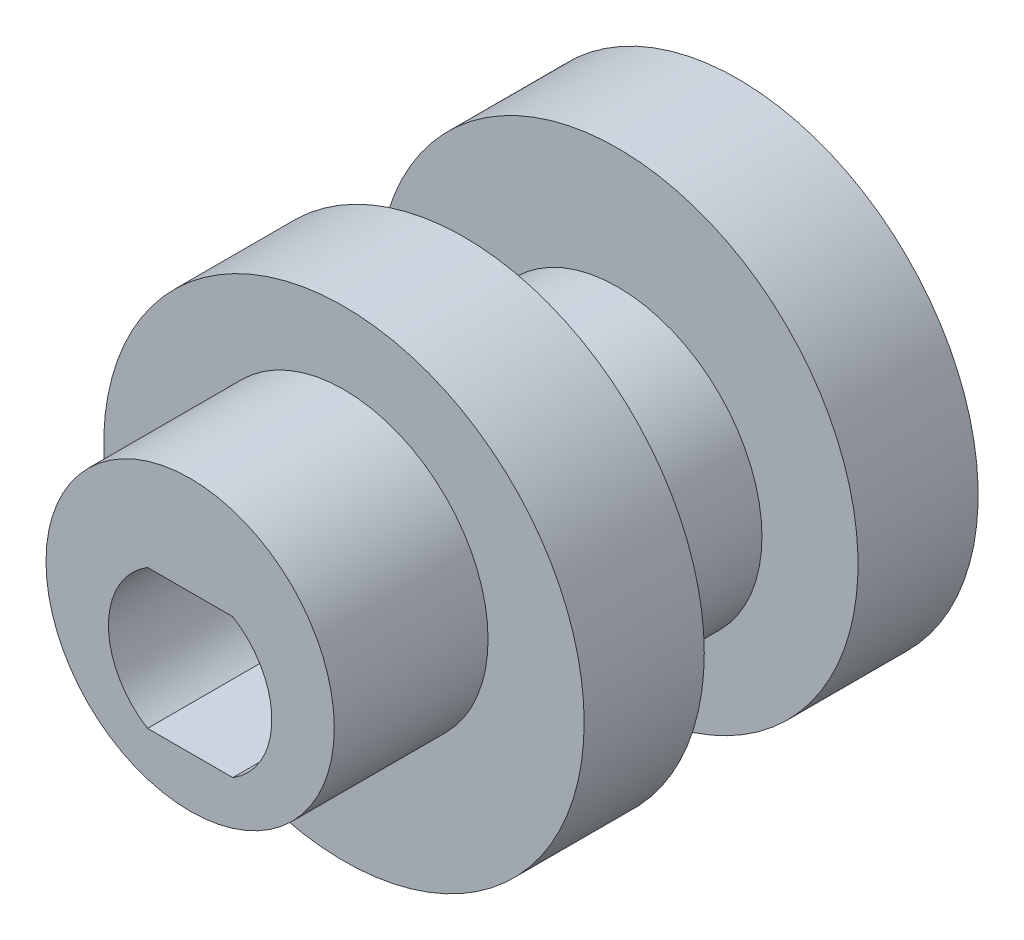
ISO-10303-21;
HEADER;
FILE_DESCRIPTION(('STEP AP214'),'2;1');
FILE_NAME('part.step','',(''),(''),'','','');
FILE_SCHEMA(('AUTOMOTIVE_DESIGN { 1 0 10303 214 1 1 1 1 }'));
ENDSEC;
DATA;
#1=APPLICATION_CONTEXT('core data for automotive mechanical design processes');
#2=APPLICATION_PROTOCOL_DEFINITION('international standard','automotive_design',2000,#1);
#3=PRODUCT_CONTEXT('',#1,'mechanical');
#4=PRODUCT('Part','Part','',(#3));
#5=PRODUCT_RELATED_PRODUCT_CATEGORY('part','',(#4));
#6=PRODUCT_DEFINITION_FORMATION('','',#4);
#7=PRODUCT_DEFINITION_CONTEXT('part definition',#1,'design');
#8=PRODUCT_DEFINITION('design','',#6,#7);
#9=PRODUCT_DEFINITION_SHAPE('','',#8);
#10=(LENGTH_UNIT() NAMED_UNIT(*) SI_UNIT(.MILLI.,.METRE.));
#11=(NAMED_UNIT(*) PLANE_ANGLE_UNIT() SI_UNIT($,.RADIAN.));
#12=(NAMED_UNIT(*) SI_UNIT($,.STERADIAN.) SOLID_ANGLE_UNIT());
#13=UNCERTAINTY_MEASURE_WITH_UNIT(LENGTH_MEASURE(1.E-05),#10,'distance_accuracy_value','');
#14=(GEOMETRIC_REPRESENTATION_CONTEXT(3) GLOBAL_UNCERTAINTY_ASSIGNED_CONTEXT((#13)) GLOBAL_UNIT_ASSIGNED_CONTEXT((#10,
#11,#12)) REPRESENTATION_CONTEXT('',''));
#15=CARTESIAN_POINT('',(0.,0.,0.));
#16=DIRECTION('',(0.,0.,1.));
#17=DIRECTION('',(1.,0.,0.));
#18=AXIS2_PLACEMENT_3D('',#15,#16,#17);
#19=CARTESIAN_POINT('',(0.,0.,2.5));
#20=DIRECTION('',(0.,0.,-1.));
#21=DIRECTION('',(-1.,0.,0.));
#22=AXIS2_PLACEMENT_3D('',#19,#20,#21);
#23=CYLINDRICAL_SURFACE('',#22,10.);
#24=CARTESIAN_POINT('',(0.,0.,2.5));
#25=DIRECTION('',(0.,0.,1.));
#26=DIRECTION('',(1.,0.,0.));
#27=AXIS2_PLACEMENT_3D('',#24,#25,#26);
#28=CIRCLE('',#27,10.);
#29=CARTESIAN_POINT('',(10.,0.,2.5));
#30=VERTEX_POINT('',#29);
#31=EDGE_CURVE('E153',#30,#30,#28,.T.);
#32=ORIENTED_EDGE('',*,*,#31,.F.);
#33=EDGE_LOOP('',(#32));
#34=FACE_BOUND('',#33,.T.);
#35=CARTESIAN_POINT('',(0.,0.,-2.5));
#36=DIRECTION('',(0.,0.,1.));
#37=DIRECTION('',(1.,0.,0.));
#38=AXIS2_PLACEMENT_3D('',#35,#36,#37);
#39=CIRCLE('',#38,10.);
#40=CARTESIAN_POINT('',(10.,0.,-2.5));
#41=VERTEX_POINT('',#40);
#42=EDGE_CURVE('E48',#41,#41,#39,.T.);
#43=ORIENTED_EDGE('',*,*,#42,.T.);
#44=EDGE_LOOP('',(#43));
#45=FACE_BOUND('',#44,.T.);
#46=ADVANCED_FACE('F45',(#34,#45),#23,.T.);
#47=CARTESIAN_POINT('',(0.,0.,2.5));
#48=DIRECTION('',(0.,0.,1.));
#49=DIRECTION('',(1.,0.,0.));
#50=AXIS2_PLACEMENT_3D('',#47,#48,#49);
#51=PLANE('',#50);
#52=CARTESIAN_POINT('',(0.,1.,2.5));
#53=DIRECTION('',(0.,0.,1.));
#54=DIRECTION('',(1.,0.,0.));
#55=AXIS2_PLACEMENT_3D('',#52,#53,#54);
#56=CIRCLE('',#55,6.);
#57=CARTESIAN_POINT('',(6.,1.,2.5));
#58=VERTEX_POINT('',#57);
#59=EDGE_CURVE('E54',#58,#58,#56,.T.);
#60=ORIENTED_EDGE('',*,*,#59,.F.);
#61=EDGE_LOOP('',(#60));
#62=FACE_BOUND('',#61,.T.);
#63=ORIENTED_EDGE('',*,*,#31,.T.);
#64=EDGE_LOOP('',(#63));
#65=FACE_BOUND('',#64,.T.);
#66=ADVANCED_FACE('F166',(#62,#65),#51,.T.);
#67=CARTESIAN_POINT('',(0.,0.,-2.5));
#68=DIRECTION('',(0.,0.,1.));
#69=DIRECTION('',(1.,0.,0.));
#70=AXIS2_PLACEMENT_3D('',#67,#68,#69);
#71=PLANE('',#70);
#72=CARTESIAN_POINT('',(0.,-1.,-2.5));
#73=DIRECTION('',(0.,0.,-1.));
#74=DIRECTION('',(-1.,0.,0.));
#75=AXIS2_PLACEMENT_3D('',#72,#73,#74);
#76=CIRCLE('',#75,6.);
#77=CARTESIAN_POINT('',(-6.,-1.,-2.5));
#78=VERTEX_POINT('',#77);
#79=EDGE_CURVE('E11',#78,#78,#76,.T.);
#80=ORIENTED_EDGE('',*,*,#79,.F.);
#81=EDGE_LOOP('',(#80));
#82=FACE_BOUND('',#81,.T.);
#83=ORIENTED_EDGE('',*,*,#42,.F.);
#84=EDGE_LOOP('',(#83));
#85=FACE_BOUND('',#84,.T.);
#86=ADVANCED_FACE('F163',(#82,#85),#71,.F.);
#87=CARTESIAN_POINT('',(0.,1.,8.9));
#88=DIRECTION('',(0.,0.,-1.));
#89=DIRECTION('',(-1.,0.,0.));
#90=AXIS2_PLACEMENT_3D('',#87,#88,#89);
#91=CYLINDRICAL_SURFACE('',#90,6.);
#92=CARTESIAN_POINT('',(0.,1.,8.9));
#93=DIRECTION('',(0.,0.,1.));
#94=DIRECTION('',(1.,0.,0.));
#95=AXIS2_PLACEMENT_3D('',#92,#93,#94);
#96=CIRCLE('',#95,6.);
#97=CARTESIAN_POINT('',(6.,1.,8.9));
#98=VERTEX_POINT('',#97);
#99=EDGE_CURVE('E146',#98,#98,#96,.T.);
#100=ORIENTED_EDGE('',*,*,#99,.F.);
#101=EDGE_LOOP('',(#100));
#102=FACE_BOUND('',#101,.T.);
#103=ORIENTED_EDGE('',*,*,#59,.T.);
#104=EDGE_LOOP('',(#103));
#105=FACE_BOUND('',#104,.T.);
#106=ADVANCED_FACE('F165',(#102,#105),#91,.T.);
#107=CARTESIAN_POINT('',(0.,1.,8.9));
#108=DIRECTION('',(0.,0.,1.));
#109=DIRECTION('',(1.,0.,0.));
#110=AXIS2_PLACEMENT_3D('',#107,#108,#109);
#111=PLANE('',#110);
#112=CARTESIAN_POINT('',(0.,0.,8.9));
#113=DIRECTION('',(0.,0.,1.));
#114=DIRECTION('',(1.,0.,0.));
#115=AXIS2_PLACEMENT_3D('',#112,#113,#114);
#116=CIRCLE('',#115,3.4);
#117=CARTESIAN_POINT('',(-1.77482393492988,2.9,8.9));
#118=VERTEX_POINT('',#117);
#119=CARTESIAN_POINT('',(-1.77482393492988,-2.9,8.9));
#120=VERTEX_POINT('',#119);
#121=EDGE_CURVE('E62',#118,#120,#116,.T.);
#122=ORIENTED_EDGE('',*,*,#121,.F.);
#123=DIRECTION('',(-1.,0.,0.));
#124=VECTOR('',#123,1.);
#125=CARTESIAN_POINT('',(-1.77482393492988,2.9,8.9));
#126=LINE('',#125,#124);
#127=CARTESIAN_POINT('',(1.77482393492989,2.9,8.9));
#128=VERTEX_POINT('',#127);
#129=EDGE_CURVE('E108',#128,#118,#126,.T.);
#130=ORIENTED_EDGE('',*,*,#129,.F.);
#131=CARTESIAN_POINT('',(0.,0.,8.9));
#132=DIRECTION('',(0.,0.,1.));
#133=DIRECTION('',(1.,0.,0.));
#134=AXIS2_PLACEMENT_3D('',#131,#132,#133);
#135=CIRCLE('',#134,3.4);
#136=CARTESIAN_POINT('',(1.77482393492988,-2.9,8.9));
#137=VERTEX_POINT('',#136);
#138=EDGE_CURVE('E90',#137,#128,#135,.T.);
#139=ORIENTED_EDGE('',*,*,#138,.F.);
#140=DIRECTION('',(1.,0.,0.));
#141=VECTOR('',#140,1.);
#142=CARTESIAN_POINT('',(-1.77482393492988,-2.9,8.9));
#143=LINE('',#142,#141);
#144=EDGE_CURVE('E100',#120,#137,#143,.T.);
#145=ORIENTED_EDGE('',*,*,#144,.F.);
#146=EDGE_LOOP('',(#122,#130,#139,#145));
#147=FACE_BOUND('',#146,.T.);
#148=ORIENTED_EDGE('',*,*,#99,.T.);
#149=EDGE_LOOP('',(#148));
#150=FACE_BOUND('',#149,.T.);
#151=ADVANCED_FACE('F105',(#147,#150),#111,.T.);
#152=CARTESIAN_POINT('',(0.,-1.,-8.9));
#153=DIRECTION('',(0.,0.,1.));
#154=DIRECTION('',(1.,0.,0.));
#155=AXIS2_PLACEMENT_3D('',#152,#153,#154);
#156=CYLINDRICAL_SURFACE('',#155,6.);
#157=CARTESIAN_POINT('',(0.,-1.,-8.9));
#158=DIRECTION('',(0.,0.,-1.));
#159=DIRECTION('',(-1.,0.,0.));
#160=AXIS2_PLACEMENT_3D('',#157,#158,#159);
#161=CIRCLE('',#160,6.);
#162=CARTESIAN_POINT('',(-6.,-1.,-8.9));
#163=VERTEX_POINT('',#162);
#164=EDGE_CURVE('E140',#163,#163,#161,.T.);
#165=ORIENTED_EDGE('',*,*,#164,.F.);
#166=EDGE_LOOP('',(#165));
#167=FACE_BOUND('',#166,.T.);
#168=ORIENTED_EDGE('',*,*,#79,.T.);
#169=EDGE_LOOP('',(#168));
#170=FACE_BOUND('',#169,.T.);
#171=ADVANCED_FACE('F205',(#167,#170),#156,.T.);
#172=CARTESIAN_POINT('',(0.,0.,-13.9));
#173=DIRECTION('',(0.,0.,1.));
#174=DIRECTION('',(1.,0.,0.));
#175=AXIS2_PLACEMENT_3D('',#172,#173,#174);
#176=CYLINDRICAL_SURFACE('',#175,10.);
#177=CARTESIAN_POINT('',(0.,0.,-13.9));
#178=DIRECTION('',(0.,0.,-1.));
#179=DIRECTION('',(-1.,0.,0.));
#180=AXIS2_PLACEMENT_3D('',#177,#178,#179);
#181=CIRCLE('',#180,10.);
#182=CARTESIAN_POINT('',(-10.,0.,-13.9));
#183=VERTEX_POINT('',#182);
#184=EDGE_CURVE('E136',#183,#183,#181,.T.);
#185=ORIENTED_EDGE('',*,*,#184,.F.);
#186=EDGE_LOOP('',(#185));
#187=FACE_BOUND('',#186,.T.);
#188=CARTESIAN_POINT('',(0.,0.,-8.9));
#189=DIRECTION('',(0.,0.,-1.));
#190=DIRECTION('',(-1.,0.,0.));
#191=AXIS2_PLACEMENT_3D('',#188,#189,#190);
#192=CIRCLE('',#191,10.);
#193=CARTESIAN_POINT('',(-10.,0.,-8.9));
#194=VERTEX_POINT('',#193);
#195=EDGE_CURVE('E131',#194,#194,#192,.T.);
#196=ORIENTED_EDGE('',*,*,#195,.T.);
#197=EDGE_LOOP('',(#196));
#198=FACE_BOUND('',#197,.T.);
#199=ADVANCED_FACE('F215',(#187,#198),#176,.T.);
#200=CARTESIAN_POINT('',(0.,0.,-13.9));
#201=DIRECTION('',(0.,0.,-1.));
#202=DIRECTION('',(-1.,0.,0.));
#203=AXIS2_PLACEMENT_3D('',#200,#201,#202);
#204=PLANE('',#203);
#205=CARTESIAN_POINT('',(0.,0.,-13.9));
#206=DIRECTION('',(0.,0.,1.));
#207=DIRECTION('',(1.,0.,0.));
#208=AXIS2_PLACEMENT_3D('',#205,#206,#207);
#209=CIRCLE('',#208,3.4);
#210=CARTESIAN_POINT('',(-1.77482393492988,2.9,-13.9));
#211=VERTEX_POINT('',#210);
#212=CARTESIAN_POINT('',(-1.77482393492988,-2.9,-13.9));
#213=VERTEX_POINT('',#212);
#214=EDGE_CURVE('E112',#211,#213,#209,.T.);
#215=ORIENTED_EDGE('',*,*,#214,.T.);
#216=DIRECTION('',(1.,0.,0.));
#217=VECTOR('',#216,1.);
#218=CARTESIAN_POINT('',(-1.77482393492988,-2.9,-13.9));
#219=LINE('',#218,#217);
#220=CARTESIAN_POINT('',(1.77482393492988,-2.9,-13.9));
#221=VERTEX_POINT('',#220);
#222=EDGE_CURVE('E119',#213,#221,#219,.T.);
#223=ORIENTED_EDGE('',*,*,#222,.T.);
#224=CARTESIAN_POINT('',(0.,0.,-13.9));
#225=DIRECTION('',(0.,0.,1.));
#226=DIRECTION('',(1.,0.,0.));
#227=AXIS2_PLACEMENT_3D('',#224,#225,#226);
#228=CIRCLE('',#227,3.4);
#229=CARTESIAN_POINT('',(1.77482393492989,2.9,-13.9));
#230=VERTEX_POINT('',#229);
#231=EDGE_CURVE('E70',#221,#230,#228,.T.);
#232=ORIENTED_EDGE('',*,*,#231,.T.);
#233=DIRECTION('',(-1.,0.,0.));
#234=VECTOR('',#233,1.);
#235=CARTESIAN_POINT('',(-1.77482393492988,2.9,-13.9));
#236=LINE('',#235,#234);
#237=EDGE_CURVE('E124',#230,#211,#236,.T.);
#238=ORIENTED_EDGE('',*,*,#237,.T.);
#239=EDGE_LOOP('',(#215,#223,#232,#238));
#240=FACE_BOUND('',#239,.T.);
#241=ORIENTED_EDGE('',*,*,#184,.T.);
#242=EDGE_LOOP('',(#241));
#243=FACE_BOUND('',#242,.T.);
#244=ADVANCED_FACE('F225',(#240,#243),#204,.T.);
#245=CARTESIAN_POINT('',(0.,0.,-8.9));
#246=DIRECTION('',(0.,0.,-1.));
#247=DIRECTION('',(-1.,0.,0.));
#248=AXIS2_PLACEMENT_3D('',#245,#246,#247);
#249=PLANE('',#248);
#250=ORIENTED_EDGE('',*,*,#164,.T.);
#251=EDGE_LOOP('',(#250));
#252=FACE_BOUND('',#251,.T.);
#253=ORIENTED_EDGE('',*,*,#195,.F.);
#254=EDGE_LOOP('',(#253));
#255=FACE_BOUND('',#254,.T.);
#256=ADVANCED_FACE('F234',(#252,#255),#249,.F.);
#257=CARTESIAN_POINT('',(0.,0.,-13.9));
#258=DIRECTION('',(0.,0.,1.));
#259=DIRECTION('',(1.,0.,0.));
#260=AXIS2_PLACEMENT_3D('',#257,#258,#259);
#261=CYLINDRICAL_SURFACE('',#260,3.4);
#262=DIRECTION('',(0.,0.,1.));
#263=VECTOR('',#262,1.);
#264=CARTESIAN_POINT('',(-1.77482393492988,-2.9,-13.9));
#265=LINE('',#264,#263);
#266=EDGE_CURVE('E97',#213,#120,#265,.T.);
#267=ORIENTED_EDGE('',*,*,#266,.F.);
#268=ORIENTED_EDGE('',*,*,#214,.F.);
#269=DIRECTION('',(0.,0.,1.));
#270=VECTOR('',#269,1.);
#271=CARTESIAN_POINT('',(-1.77482393492988,2.9,-13.9));
#272=LINE('',#271,#270);
#273=EDGE_CURVE('E128',#211,#118,#272,.T.);
#274=ORIENTED_EDGE('',*,*,#273,.T.);
#275=ORIENTED_EDGE('',*,*,#121,.T.);
#276=EDGE_LOOP('',(#267,#268,#274,#275));
#277=FACE_BOUND('',#276,.T.);
#278=ADVANCED_FACE('F244',(#277),#261,.F.);
#279=CARTESIAN_POINT('',(-1.77482393492988,2.9,-13.9));
#280=DIRECTION('',(0.,1.,0.));
#281=DIRECTION('',(-1.,0.,0.));
#282=AXIS2_PLACEMENT_3D('',#279,#280,#281);
#283=PLANE('',#282);
#284=ORIENTED_EDGE('',*,*,#273,.F.);
#285=ORIENTED_EDGE('',*,*,#237,.F.);
#286=DIRECTION('',(0.,0.,1.));
#287=VECTOR('',#286,1.);
#288=CARTESIAN_POINT('',(1.77482393492989,2.9,-13.9));
#289=LINE('',#288,#287);
#290=EDGE_CURVE('E96',#230,#128,#289,.T.);
#291=ORIENTED_EDGE('',*,*,#290,.T.);
#292=ORIENTED_EDGE('',*,*,#129,.T.);
#293=EDGE_LOOP('',(#284,#285,#291,#292));
#294=FACE_BOUND('',#293,.T.);
#295=ADVANCED_FACE('F253',(#294),#283,.F.);
#296=CARTESIAN_POINT('',(0.,0.,-13.9));
#297=DIRECTION('',(0.,0.,1.));
#298=DIRECTION('',(1.,0.,0.));
#299=AXIS2_PLACEMENT_3D('',#296,#297,#298);
#300=CYLINDRICAL_SURFACE('',#299,3.4);
#301=ORIENTED_EDGE('',*,*,#290,.F.);
#302=ORIENTED_EDGE('',*,*,#231,.F.);
#303=DIRECTION('',(0.,0.,1.));
#304=VECTOR('',#303,1.);
#305=CARTESIAN_POINT('',(1.77482393492988,-2.9,-13.9));
#306=LINE('',#305,#304);
#307=EDGE_CURVE('E86',#221,#137,#306,.T.);
#308=ORIENTED_EDGE('',*,*,#307,.T.);
#309=ORIENTED_EDGE('',*,*,#138,.T.);
#310=EDGE_LOOP('',(#301,#302,#308,#309));
#311=FACE_BOUND('',#310,.T.);
#312=ADVANCED_FACE('F88',(#311),#300,.F.);
#313=CARTESIAN_POINT('',(-1.77482393492988,-2.9,-13.9));
#314=DIRECTION('',(0.,-1.,0.));
#315=DIRECTION('',(0.,0.,-1.));
#316=AXIS2_PLACEMENT_3D('',#313,#314,#315);
#317=PLANE('',#316);
#318=ORIENTED_EDGE('',*,*,#307,.F.);
#319=ORIENTED_EDGE('',*,*,#222,.F.);
#320=ORIENTED_EDGE('',*,*,#266,.T.);
#321=ORIENTED_EDGE('',*,*,#144,.T.);
#322=EDGE_LOOP('',(#318,#319,#320,#321));
#323=FACE_BOUND('',#322,.T.);
#324=ADVANCED_FACE('F101',(#323),#317,.F.);
#325=CLOSED_SHELL('',(#46,#66,#86,#106,#151,#171,#199,#244,#256,#278,#295,#312,#324));
#326=MANIFOLD_SOLID_BREP('B2',#325);
#327=ADVANCED_BREP_SHAPE_REPRESENTATION('',(#18,#326),#14);
#328=SHAPE_DEFINITION_REPRESENTATION(#9,#327);
ENDSEC;
END-ISO-10303-21;
